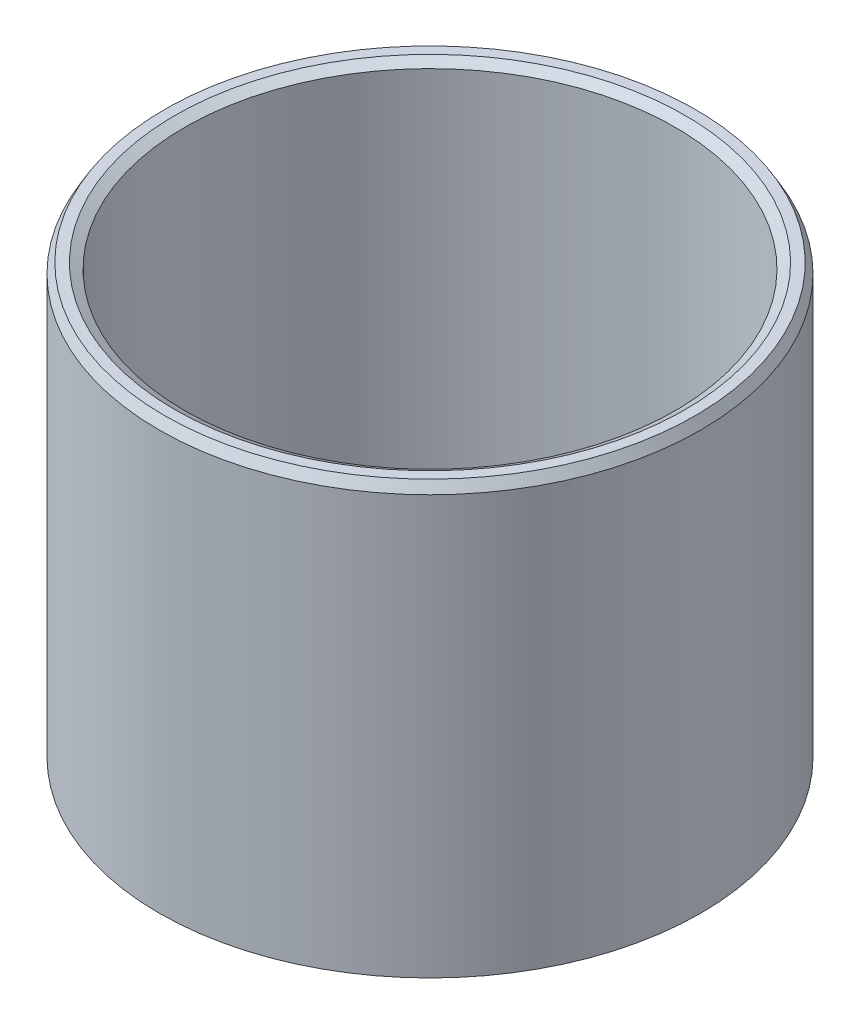
ISO-10303-21;
HEADER;
FILE_DESCRIPTION(('STEP AP214'),'2;1');
FILE_NAME('part.step','',(''),(''),'','','');
FILE_SCHEMA(('AUTOMOTIVE_DESIGN { 1 0 10303 214 1 1 1 1 }'));
ENDSEC;
DATA;
#1=APPLICATION_CONTEXT('core data for automotive mechanical design processes');
#2=APPLICATION_PROTOCOL_DEFINITION('international standard','automotive_design',2000,#1);
#3=PRODUCT_CONTEXT('',#1,'mechanical');
#4=PRODUCT('Part','Part','',(#3));
#5=PRODUCT_RELATED_PRODUCT_CATEGORY('part','',(#4));
#6=PRODUCT_DEFINITION_FORMATION('','',#4);
#7=PRODUCT_DEFINITION_CONTEXT('part definition',#1,'design');
#8=PRODUCT_DEFINITION('design','',#6,#7);
#9=PRODUCT_DEFINITION_SHAPE('','',#8);
#10=(LENGTH_UNIT() NAMED_UNIT(*) SI_UNIT(.MILLI.,.METRE.));
#11=(NAMED_UNIT(*) PLANE_ANGLE_UNIT() SI_UNIT($,.RADIAN.));
#12=(NAMED_UNIT(*) SI_UNIT($,.STERADIAN.) SOLID_ANGLE_UNIT());
#13=UNCERTAINTY_MEASURE_WITH_UNIT(LENGTH_MEASURE(1.E-05),#10,'distance_accuracy_value','');
#14=(GEOMETRIC_REPRESENTATION_CONTEXT(3) GLOBAL_UNCERTAINTY_ASSIGNED_CONTEXT((#13)) GLOBAL_UNIT_ASSIGNED_CONTEXT((#10,
#11,#12)) REPRESENTATION_CONTEXT('',''));
#15=CARTESIAN_POINT('',(0.,0.,0.));
#16=DIRECTION('',(0.,0.,1.));
#17=DIRECTION('',(1.,0.,0.));
#18=AXIS2_PLACEMENT_3D('',#15,#16,#17);
#19=CARTESIAN_POINT('',(0.,84.0536093106861,0.));
#20=DIRECTION('',(0.,-1.,0.));
#21=DIRECTION('',(0.,0.,-1.));
#22=AXIS2_PLACEMENT_3D('',#19,#20,#21);
#23=CYLINDRICAL_SURFACE('',#22,52.5);
#24=CARTESIAN_POINT('',(0.,1.07608079800703,0.));
#25=DIRECTION('',(0.,1.,0.));
#26=DIRECTION('',(0.,0.,1.));
#27=AXIS2_PLACEMENT_3D('',#24,#25,#26);
#28=CIRCLE('',#27,52.5);
#29=CARTESIAN_POINT('',(0.,1.07608079800703,52.5));
#30=VERTEX_POINT('',#29);
#31=EDGE_CURVE('E10',#30,#30,#28,.T.);
#32=ORIENTED_EDGE('',*,*,#31,.T.);
#33=EDGE_LOOP('',(#32));
#34=FACE_BOUND('',#33,.T.);
#35=CARTESIAN_POINT('',(0.,82.1897826954886,0.));
#36=DIRECTION('',(0.,1.,0.));
#37=DIRECTION('',(0.,0.,1.));
#38=AXIS2_PLACEMENT_3D('',#35,#36,#37);
#39=CIRCLE('',#38,52.5);
#40=CARTESIAN_POINT('',(0.,82.1897826954886,52.5));
#41=VERTEX_POINT('',#40);
#42=EDGE_CURVE('E50',#41,#41,#39,.F.);
#43=ORIENTED_EDGE('',*,*,#42,.T.);
#44=EDGE_LOOP('',(#43));
#45=FACE_BOUND('',#44,.T.);
#46=ADVANCED_FACE('F39',(#34,#45),#23,.T.);
#47=CARTESIAN_POINT('',(0.,84.0536093106861,0.));
#48=DIRECTION('',(0.,1.,0.));
#49=DIRECTION('',(0.,0.,1.));
#50=AXIS2_PLACEMENT_3D('',#47,#48,#49);
#51=PLANE('',#50);
#52=CARTESIAN_POINT('',(0.,84.0536093106861,0.));
#53=DIRECTION('',(0.,1.,0.));
#54=DIRECTION('',(0.,0.,1.));
#55=AXIS2_PLACEMENT_3D('',#52,#53,#54);
#56=CIRCLE('',#55,49.4247003501514);
#57=CARTESIAN_POINT('',(0.,84.0536093106861,49.4247003501514));
#58=VERTEX_POINT('',#57);
#59=EDGE_CURVE('E58',#58,#58,#56,.F.);
#60=ORIENTED_EDGE('',*,*,#59,.T.);
#61=EDGE_LOOP('',(#60));
#62=FACE_BOUND('',#61,.T.);
#63=CARTESIAN_POINT('',(0.,84.0536093106861,0.));
#64=DIRECTION('',(0.,1.,0.));
#65=DIRECTION('',(0.,0.,1.));
#66=AXIS2_PLACEMENT_3D('',#63,#64,#65);
#67=CIRCLE('',#66,51.423919201993);
#68=CARTESIAN_POINT('',(0.,84.0536093106861,51.423919201993));
#69=VERTEX_POINT('',#68);
#70=EDGE_CURVE('E61',#69,#69,#67,.T.);
#71=ORIENTED_EDGE('',*,*,#70,.T.);
#72=EDGE_LOOP('',(#71));
#73=FACE_BOUND('',#72,.T.);
#74=ADVANCED_FACE('F88',(#62,#73),#51,.T.);
#75=CARTESIAN_POINT('',(0.,0.,0.));
#76=DIRECTION('',(0.,1.,0.));
#77=DIRECTION('',(0.,0.,1.));
#78=AXIS2_PLACEMENT_3D('',#75,#76,#77);
#79=PLANE('',#78);
#80=CARTESIAN_POINT('',(0.,0.,0.));
#81=DIRECTION('',(0.,1.,0.));
#82=DIRECTION('',(0.,0.,1.));
#83=AXIS2_PLACEMENT_3D('',#80,#81,#82);
#84=CIRCLE('',#83,48.636954532961);
#85=CARTESIAN_POINT('',(0.,0.,48.636954532961));
#86=VERTEX_POINT('',#85);
#87=EDGE_CURVE('E51',#86,#86,#84,.T.);
#88=ORIENTED_EDGE('',*,*,#87,.T.);
#89=EDGE_LOOP('',(#88));
#90=FACE_BOUND('',#89,.T.);
#91=CARTESIAN_POINT('',(0.,0.,0.));
#92=DIRECTION('',(0.,1.,0.));
#93=DIRECTION('',(0.,0.,1.));
#94=AXIS2_PLACEMENT_3D('',#91,#92,#93);
#95=CIRCLE('',#94,50.6361733848026);
#96=CARTESIAN_POINT('',(0.,0.,50.6361733848026));
#97=VERTEX_POINT('',#96);
#98=EDGE_CURVE('E54',#97,#97,#95,.F.);
#99=ORIENTED_EDGE('',*,*,#98,.T.);
#100=EDGE_LOOP('',(#99));
#101=FACE_BOUND('',#100,.T.);
#102=ADVANCED_FACE('F83',(#90,#101),#79,.F.);
#103=CARTESIAN_POINT('',(0.,84.0536093106861,0.));
#104=DIRECTION('',(0.,-1.,0.));
#105=DIRECTION('',(0.,0.,-1.));
#106=AXIS2_PLACEMENT_3D('',#103,#104,#105);
#107=CYLINDRICAL_SURFACE('',#106,47.5608737349539);
#108=CARTESIAN_POINT('',(0.,82.977528512679,0.));
#109=DIRECTION('',(0.,1.,0.));
#110=DIRECTION('',(0.,0.,1.));
#111=AXIS2_PLACEMENT_3D('',#108,#109,#110);
#112=CIRCLE('',#111,47.5608737349539);
#113=CARTESIAN_POINT('',(0.,82.977528512679,47.5608737349539));
#114=VERTEX_POINT('',#113);
#115=EDGE_CURVE('E67',#114,#114,#112,.T.);
#116=ORIENTED_EDGE('',*,*,#115,.T.);
#117=EDGE_LOOP('',(#116));
#118=FACE_BOUND('',#117,.T.);
#119=CARTESIAN_POINT('',(0.,1.86382661519743,0.));
#120=DIRECTION('',(0.,1.,0.));
#121=DIRECTION('',(0.,0.,1.));
#122=AXIS2_PLACEMENT_3D('',#119,#120,#121);
#123=CIRCLE('',#122,47.5608737349539);
#124=CARTESIAN_POINT('',(0.,1.86382661519743,47.5608737349539));
#125=VERTEX_POINT('',#124);
#126=EDGE_CURVE('E69',#125,#125,#123,.F.);
#127=ORIENTED_EDGE('',*,*,#126,.T.);
#128=EDGE_LOOP('',(#127));
#129=FACE_BOUND('',#128,.T.);
#130=ADVANCED_FACE('F71',(#118,#129),#107,.F.);
#131=CARTESIAN_POINT('',(0.,82.977528512679,0.));
#132=DIRECTION('',(0.,1.,0.));
#133=DIRECTION('',(0.,0.,1.));
#134=AXIS2_PLACEMENT_3D('',#131,#132,#133);
#135=CONICAL_SURFACE('',#134,47.5608737349539,1.0471975511966);
#136=ORIENTED_EDGE('',*,*,#59,.F.);
#137=EDGE_LOOP('',(#136));
#138=FACE_BOUND('',#137,.T.);
#139=ORIENTED_EDGE('',*,*,#115,.F.);
#140=EDGE_LOOP('',(#139));
#141=FACE_BOUND('',#140,.T.);
#142=ADVANCED_FACE('F77',(#138,#141),#135,.F.);
#143=CARTESIAN_POINT('',(0.,0.,0.));
#144=DIRECTION('',(0.,-1.,0.));
#145=DIRECTION('',(0.,0.,-1.));
#146=AXIS2_PLACEMENT_3D('',#143,#144,#145);
#147=CONICAL_SURFACE('',#146,48.636954532961,0.523598775598294);
#148=ORIENTED_EDGE('',*,*,#126,.F.);
#149=EDGE_LOOP('',(#148));
#150=FACE_BOUND('',#149,.T.);
#151=ORIENTED_EDGE('',*,*,#87,.F.);
#152=EDGE_LOOP('',(#151));
#153=FACE_BOUND('',#152,.T.);
#154=ADVANCED_FACE('F73',(#150,#153),#147,.F.);
#155=CARTESIAN_POINT('',(0.,1.07608079800703,0.));
#156=DIRECTION('',(0.,1.,0.));
#157=DIRECTION('',(0.,0.,1.));
#158=AXIS2_PLACEMENT_3D('',#155,#156,#157);
#159=CONICAL_SURFACE('',#158,52.5,1.04719755119659);
#160=ORIENTED_EDGE('',*,*,#98,.F.);
#161=EDGE_LOOP('',(#160));
#162=FACE_BOUND('',#161,.T.);
#163=ORIENTED_EDGE('',*,*,#31,.F.);
#164=EDGE_LOOP('',(#163));
#165=FACE_BOUND('',#164,.T.);
#166=ADVANCED_FACE('F76',(#162,#165),#159,.T.);
#167=CARTESIAN_POINT('',(0.,84.0536093106861,0.));
#168=DIRECTION('',(0.,-1.,0.));
#169=DIRECTION('',(0.,0.,-1.));
#170=AXIS2_PLACEMENT_3D('',#167,#168,#169);
#171=CONICAL_SURFACE('',#170,51.423919201993,0.523598775598295);
#172=ORIENTED_EDGE('',*,*,#42,.F.);
#173=EDGE_LOOP('',(#172));
#174=FACE_BOUND('',#173,.T.);
#175=ORIENTED_EDGE('',*,*,#70,.F.);
#176=EDGE_LOOP('',(#175));
#177=FACE_BOUND('',#176,.T.);
#178=ADVANCED_FACE('F45',(#174,#177),#171,.T.);
#179=CLOSED_SHELL('',(#46,#74,#102,#130,#142,#154,#166,#178));
#180=MANIFOLD_SOLID_BREP('B2',#179);
#181=ADVANCED_BREP_SHAPE_REPRESENTATION('',(#18,#180),#14);
#182=SHAPE_DEFINITION_REPRESENTATION(#9,#181);
ENDSEC;
END-ISO-10303-21;
